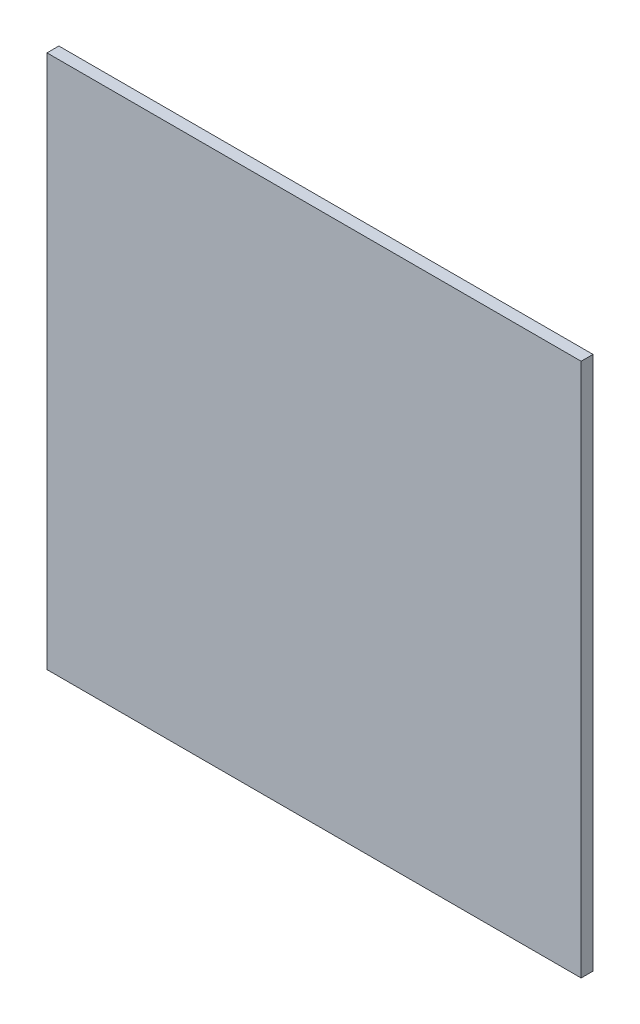
ISO-10303-21;
HEADER;
FILE_DESCRIPTION(('STEP AP214'),'2;1');
FILE_NAME('part.step','',(''),(''),'','','');
FILE_SCHEMA(('AUTOMOTIVE_DESIGN { 1 0 10303 214 1 1 1 1 }'));
ENDSEC;
DATA;
#1=APPLICATION_CONTEXT('core data for automotive mechanical design processes');
#2=APPLICATION_PROTOCOL_DEFINITION('international standard','automotive_design',2000,#1);
#3=PRODUCT_CONTEXT('',#1,'mechanical');
#4=PRODUCT('Part','Part','',(#3));
#5=PRODUCT_RELATED_PRODUCT_CATEGORY('part','',(#4));
#6=PRODUCT_DEFINITION_FORMATION('','',#4);
#7=PRODUCT_DEFINITION_CONTEXT('part definition',#1,'design');
#8=PRODUCT_DEFINITION('design','',#6,#7);
#9=PRODUCT_DEFINITION_SHAPE('','',#8);
#10=(LENGTH_UNIT() NAMED_UNIT(*) SI_UNIT(.MILLI.,.METRE.));
#11=(NAMED_UNIT(*) PLANE_ANGLE_UNIT() SI_UNIT($,.RADIAN.));
#12=(NAMED_UNIT(*) SI_UNIT($,.STERADIAN.) SOLID_ANGLE_UNIT());
#13=UNCERTAINTY_MEASURE_WITH_UNIT(LENGTH_MEASURE(1.E-05),#10,'distance_accuracy_value','');
#14=(GEOMETRIC_REPRESENTATION_CONTEXT(3) GLOBAL_UNCERTAINTY_ASSIGNED_CONTEXT((#13)) GLOBAL_UNIT_ASSIGNED_CONTEXT((#10,
#11,#12)) REPRESENTATION_CONTEXT('',''));
#15=CARTESIAN_POINT('',(0.,0.,0.));
#16=DIRECTION('',(0.,0.,1.));
#17=DIRECTION('',(1.,0.,0.));
#18=AXIS2_PLACEMENT_3D('',#15,#16,#17);
#19=CARTESIAN_POINT('',(22.5,22.5,1.));
#20=DIRECTION('',(-1.,0.,0.));
#21=DIRECTION('',(0.,-1.,0.));
#22=AXIS2_PLACEMENT_3D('',#19,#20,#21);
#23=PLANE('',#22);
#24=DIRECTION('',(0.,1.,0.));
#25=VECTOR('',#24,1.);
#26=CARTESIAN_POINT('',(22.5,22.5,0.));
#27=LINE('',#26,#25);
#28=CARTESIAN_POINT('',(22.5,-22.5,0.));
#29=VERTEX_POINT('',#28);
#30=CARTESIAN_POINT('',(22.5,22.5,0.));
#31=VERTEX_POINT('',#30);
#32=EDGE_CURVE('E97',#29,#31,#27,.T.);
#33=ORIENTED_EDGE('',*,*,#32,.T.);
#34=DIRECTION('',(0.,0.,-1.));
#35=VECTOR('',#34,1.);
#36=CARTESIAN_POINT('',(22.5,22.5,1.));
#37=LINE('',#36,#35);
#38=CARTESIAN_POINT('',(22.5,22.5,1.));
#39=VERTEX_POINT('',#38);
#40=EDGE_CURVE('E11',#39,#31,#37,.T.);
#41=ORIENTED_EDGE('',*,*,#40,.F.);
#42=DIRECTION('',(0.,1.,0.));
#43=VECTOR('',#42,1.);
#44=CARTESIAN_POINT('',(22.5,22.5,1.));
#45=LINE('',#44,#43);
#46=CARTESIAN_POINT('',(22.5,-22.5,1.));
#47=VERTEX_POINT('',#46);
#48=EDGE_CURVE('E85',#47,#39,#45,.T.);
#49=ORIENTED_EDGE('',*,*,#48,.F.);
#50=DIRECTION('',(0.,0.,-1.));
#51=VECTOR('',#50,1.);
#52=CARTESIAN_POINT('',(22.5,-22.5,1.));
#53=LINE('',#52,#51);
#54=EDGE_CURVE('E93',#47,#29,#53,.T.);
#55=ORIENTED_EDGE('',*,*,#54,.T.);
#56=EDGE_LOOP('',(#33,#41,#49,#55));
#57=FACE_BOUND('',#56,.T.);
#58=ADVANCED_FACE('F34',(#57),#23,.F.);
#59=CARTESIAN_POINT('',(-22.5,22.5,1.));
#60=DIRECTION('',(0.,-1.,0.));
#61=DIRECTION('',(0.,0.,-1.));
#62=AXIS2_PLACEMENT_3D('',#59,#60,#61);
#63=PLANE('',#62);
#64=DIRECTION('',(-1.,0.,0.));
#65=VECTOR('',#64,1.);
#66=CARTESIAN_POINT('',(-22.5,22.5,0.));
#67=LINE('',#66,#65);
#68=CARTESIAN_POINT('',(-22.5,22.5,0.));
#69=VERTEX_POINT('',#68);
#70=EDGE_CURVE('E89',#31,#69,#67,.T.);
#71=ORIENTED_EDGE('',*,*,#70,.T.);
#72=DIRECTION('',(0.,0.,-1.));
#73=VECTOR('',#72,1.);
#74=CARTESIAN_POINT('',(-22.5,22.5,1.));
#75=LINE('',#74,#73);
#76=CARTESIAN_POINT('',(-22.5,22.5,1.));
#77=VERTEX_POINT('',#76);
#78=EDGE_CURVE('E42',#77,#69,#75,.T.);
#79=ORIENTED_EDGE('',*,*,#78,.F.);
#80=DIRECTION('',(-1.,0.,0.));
#81=VECTOR('',#80,1.);
#82=CARTESIAN_POINT('',(-22.5,22.5,1.));
#83=LINE('',#82,#81);
#84=EDGE_CURVE('E80',#39,#77,#83,.T.);
#85=ORIENTED_EDGE('',*,*,#84,.F.);
#86=ORIENTED_EDGE('',*,*,#40,.T.);
#87=EDGE_LOOP('',(#71,#79,#85,#86));
#88=FACE_BOUND('',#87,.T.);
#89=ADVANCED_FACE('F88',(#88),#63,.F.);
#90=CARTESIAN_POINT('',(-22.5,22.5,1.));
#91=DIRECTION('',(1.,0.,0.));
#92=DIRECTION('',(0.,1.,0.));
#93=AXIS2_PLACEMENT_3D('',#90,#91,#92);
#94=PLANE('',#93);
#95=DIRECTION('',(0.,-1.,0.));
#96=VECTOR('',#95,1.);
#97=CARTESIAN_POINT('',(-22.5,22.5,0.));
#98=LINE('',#97,#96);
#99=CARTESIAN_POINT('',(-22.5,-22.5,0.));
#100=VERTEX_POINT('',#99);
#101=EDGE_CURVE('E67',#69,#100,#98,.T.);
#102=ORIENTED_EDGE('',*,*,#101,.T.);
#103=DIRECTION('',(0.,0.,-1.));
#104=VECTOR('',#103,1.);
#105=CARTESIAN_POINT('',(-22.5,-22.5,1.));
#106=LINE('',#105,#104);
#107=CARTESIAN_POINT('',(-22.5,-22.5,1.));
#108=VERTEX_POINT('',#107);
#109=EDGE_CURVE('E90',#108,#100,#106,.T.);
#110=ORIENTED_EDGE('',*,*,#109,.F.);
#111=DIRECTION('',(0.,-1.,0.));
#112=VECTOR('',#111,1.);
#113=CARTESIAN_POINT('',(-22.5,22.5,1.));
#114=LINE('',#113,#112);
#115=EDGE_CURVE('E83',#77,#108,#114,.T.);
#116=ORIENTED_EDGE('',*,*,#115,.F.);
#117=ORIENTED_EDGE('',*,*,#78,.T.);
#118=EDGE_LOOP('',(#102,#110,#116,#117));
#119=FACE_BOUND('',#118,.T.);
#120=ADVANCED_FACE('F91',(#119),#94,.F.);
#121=CARTESIAN_POINT('',(-22.5,-22.5,1.));
#122=DIRECTION('',(0.,1.,0.));
#123=DIRECTION('',(0.,0.,1.));
#124=AXIS2_PLACEMENT_3D('',#121,#122,#123);
#125=PLANE('',#124);
#126=DIRECTION('',(1.,0.,0.));
#127=VECTOR('',#126,1.);
#128=CARTESIAN_POINT('',(-22.5,-22.5,0.));
#129=LINE('',#128,#127);
#130=EDGE_CURVE('E73',#100,#29,#129,.T.);
#131=ORIENTED_EDGE('',*,*,#130,.T.);
#132=ORIENTED_EDGE('',*,*,#54,.F.);
#133=DIRECTION('',(1.,0.,0.));
#134=VECTOR('',#133,1.);
#135=CARTESIAN_POINT('',(-22.5,-22.5,1.));
#136=LINE('',#135,#134);
#137=EDGE_CURVE('E50',#108,#47,#136,.T.);
#138=ORIENTED_EDGE('',*,*,#137,.F.);
#139=ORIENTED_EDGE('',*,*,#109,.T.);
#140=EDGE_LOOP('',(#131,#132,#138,#139));
#141=FACE_BOUND('',#140,.T.);
#142=ADVANCED_FACE('F104',(#141),#125,.F.);
#143=CARTESIAN_POINT('',(0.,0.,1.));
#144=DIRECTION('',(0.,0.,1.));
#145=DIRECTION('',(1.,0.,0.));
#146=AXIS2_PLACEMENT_3D('',#143,#144,#145);
#147=PLANE('',#146);
#148=ORIENTED_EDGE('',*,*,#48,.T.);
#149=ORIENTED_EDGE('',*,*,#84,.T.);
#150=ORIENTED_EDGE('',*,*,#115,.T.);
#151=ORIENTED_EDGE('',*,*,#137,.T.);
#152=EDGE_LOOP('',(#148,#149,#150,#151));
#153=FACE_BOUND('',#152,.T.);
#154=ADVANCED_FACE('F81',(#153),#147,.T.);
#155=CARTESIAN_POINT('',(0.,0.,0.));
#156=DIRECTION('',(0.,0.,1.));
#157=DIRECTION('',(1.,0.,0.));
#158=AXIS2_PLACEMENT_3D('',#155,#156,#157);
#159=PLANE('',#158);
#160=ORIENTED_EDGE('',*,*,#32,.F.);
#161=ORIENTED_EDGE('',*,*,#130,.F.);
#162=ORIENTED_EDGE('',*,*,#101,.F.);
#163=ORIENTED_EDGE('',*,*,#70,.F.);
#164=EDGE_LOOP('',(#160,#161,#162,#163));
#165=FACE_BOUND('',#164,.T.);
#166=ADVANCED_FACE('F107',(#165),#159,.F.);
#167=CLOSED_SHELL('',(#58,#89,#120,#142,#154,#166));
#168=MANIFOLD_SOLID_BREP('B2',#167);
#169=ADVANCED_BREP_SHAPE_REPRESENTATION('',(#18,#168),#14);
#170=SHAPE_DEFINITION_REPRESENTATION(#9,#169);
ENDSEC;
END-ISO-10303-21;
